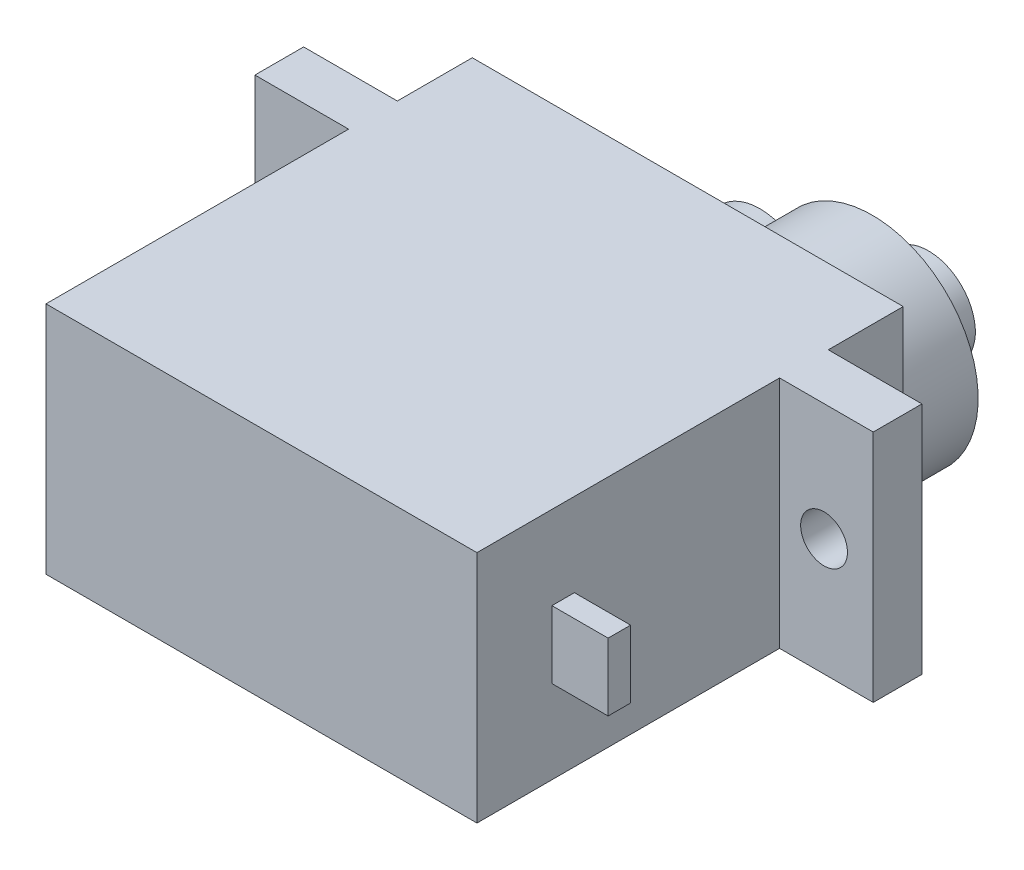
ISO-10303-21;
HEADER;
FILE_DESCRIPTION(('STEP AP214'),'2;1');
FILE_NAME('part.step','',(''),(''),'','','');
FILE_SCHEMA(('AUTOMOTIVE_DESIGN { 1 0 10303 214 1 1 1 1 }'));
ENDSEC;
DATA;
#1=APPLICATION_CONTEXT('core data for automotive mechanical design processes');
#2=APPLICATION_PROTOCOL_DEFINITION('international standard','automotive_design',2000,#1);
#3=PRODUCT_CONTEXT('',#1,'mechanical');
#4=PRODUCT('Part','Part','',(#3));
#5=PRODUCT_RELATED_PRODUCT_CATEGORY('part','',(#4));
#6=PRODUCT_DEFINITION_FORMATION('','',#4);
#7=PRODUCT_DEFINITION_CONTEXT('part definition',#1,'design');
#8=PRODUCT_DEFINITION('design','',#6,#7);
#9=PRODUCT_DEFINITION_SHAPE('','',#8);
#10=(LENGTH_UNIT() NAMED_UNIT(*) SI_UNIT(.MILLI.,.METRE.));
#11=(NAMED_UNIT(*) PLANE_ANGLE_UNIT() SI_UNIT($,.RADIAN.));
#12=(NAMED_UNIT(*) SI_UNIT($,.STERADIAN.) SOLID_ANGLE_UNIT());
#13=UNCERTAINTY_MEASURE_WITH_UNIT(LENGTH_MEASURE(1.E-05),#10,'distance_accuracy_value','');
#14=(GEOMETRIC_REPRESENTATION_CONTEXT(3) GLOBAL_UNCERTAINTY_ASSIGNED_CONTEXT((#13)) GLOBAL_UNIT_ASSIGNED_CONTEXT((#10,
#11,#12)) REPRESENTATION_CONTEXT('',''));
#15=CARTESIAN_POINT('',(0.,0.,0.));
#16=DIRECTION('',(0.,0.,1.));
#17=DIRECTION('',(1.,0.,0.));
#18=AXIS2_PLACEMENT_3D('',#15,#16,#17);
#19=CARTESIAN_POINT('',(23.,12.5,0.));
#20=DIRECTION('',(-1.,0.,0.));
#21=DIRECTION('',(0.,0.,1.));
#22=AXIS2_PLACEMENT_3D('',#19,#20,#21);
#23=PLANE('',#22);
#24=DIRECTION('',(0.,0.,-1.));
#25=VECTOR('',#24,1.);
#26=CARTESIAN_POINT('',(23.,0.,0.));
#27=LINE('',#26,#25);
#28=CARTESIAN_POINT('',(23.,0.,0.));
#29=VERTEX_POINT('',#28);
#30=CARTESIAN_POINT('',(23.,0.,-16.15));
#31=VERTEX_POINT('',#30);
#32=EDGE_CURVE('E273',#29,#31,#27,.T.);
#33=ORIENTED_EDGE('',*,*,#32,.T.);
#34=DIRECTION('',(0.,-1.,0.));
#35=VECTOR('',#34,1.);
#36=CARTESIAN_POINT('',(23.,12.5,-16.15));
#37=LINE('',#36,#35);
#38=CARTESIAN_POINT('',(23.,12.5,-16.15));
#39=VERTEX_POINT('',#38);
#40=EDGE_CURVE('E302',#39,#31,#37,.T.);
#41=ORIENTED_EDGE('',*,*,#40,.F.);
#42=DIRECTION('',(0.,0.,-1.));
#43=VECTOR('',#42,1.);
#44=CARTESIAN_POINT('',(23.,12.5,0.));
#45=LINE('',#44,#43);
#46=CARTESIAN_POINT('',(23.,12.5,0.));
#47=VERTEX_POINT('',#46);
#48=EDGE_CURVE('E248',#47,#39,#45,.T.);
#49=ORIENTED_EDGE('',*,*,#48,.F.);
#50=DIRECTION('',(0.,-1.,0.));
#51=VECTOR('',#50,1.);
#52=CARTESIAN_POINT('',(23.,12.5,0.));
#53=LINE('',#52,#51);
#54=EDGE_CURVE('E305',#47,#29,#53,.T.);
#55=ORIENTED_EDGE('',*,*,#54,.T.);
#56=EDGE_LOOP('',(#33,#41,#49,#55));
#57=FACE_BOUND('',#56,.T.);
#58=DIRECTION('',(0.,-1.,0.));
#59=VECTOR('',#58,1.);
#60=CARTESIAN_POINT('',(23.,8.05,-4.));
#61=LINE('',#60,#59);
#62=CARTESIAN_POINT('',(23.,8.05,-4.));
#63=VERTEX_POINT('',#62);
#64=CARTESIAN_POINT('',(23.,4.45,-4.));
#65=VERTEX_POINT('',#64);
#66=EDGE_CURVE('E185',#63,#65,#61,.T.);
#67=ORIENTED_EDGE('',*,*,#66,.F.);
#68=DIRECTION('',(0.,0.,1.));
#69=VECTOR('',#68,1.);
#70=CARTESIAN_POINT('',(23.,8.05,-4.));
#71=LINE('',#70,#69);
#72=CARTESIAN_POINT('',(23.,8.05,-5.2));
#73=VERTEX_POINT('',#72);
#74=EDGE_CURVE('E182',#73,#63,#71,.T.);
#75=ORIENTED_EDGE('',*,*,#74,.F.);
#76=DIRECTION('',(0.,1.,0.));
#77=VECTOR('',#76,1.);
#78=CARTESIAN_POINT('',(23.,8.05,-5.2));
#79=LINE('',#78,#77);
#80=CARTESIAN_POINT('',(23.,4.45,-5.2));
#81=VERTEX_POINT('',#80);
#82=EDGE_CURVE('E58',#81,#73,#79,.T.);
#83=ORIENTED_EDGE('',*,*,#82,.F.);
#84=DIRECTION('',(0.,0.,-1.));
#85=VECTOR('',#84,1.);
#86=CARTESIAN_POINT('',(23.,4.45,-4.));
#87=LINE('',#86,#85);
#88=EDGE_CURVE('E53',#65,#81,#87,.T.);
#89=ORIENTED_EDGE('',*,*,#88,.F.);
#90=EDGE_LOOP('',(#67,#75,#83,#89));
#91=FACE_BOUND('',#90,.T.);
#92=ADVANCED_FACE('F38',(#57,#91),#23,.F.);
#93=CARTESIAN_POINT('',(17.35,6.25,-26.75));
#94=DIRECTION('',(0.,0.,1.));
#95=DIRECTION('',(1.,0.,0.));
#96=AXIS2_PLACEMENT_3D('',#93,#94,#95);
#97=CYLINDRICAL_SURFACE('',#96,5.65);
#98=DIRECTION('',(0.,0.,1.));
#99=VECTOR('',#98,1.);
#100=CARTESIAN_POINT('',(12.415,3.49895020037805,-24.75));
#101=LINE('',#100,#99);
#102=CARTESIAN_POINT('',(12.415,3.49895020037805,-26.75));
#103=VERTEX_POINT('',#102);
#104=CARTESIAN_POINT('',(12.415,3.49895020037805,-22.75));
#105=VERTEX_POINT('',#104);
#106=EDGE_CURVE('E210',#103,#105,#101,.T.);
#107=ORIENTED_EDGE('',*,*,#106,.F.);
#108=CARTESIAN_POINT('',(17.35,6.25,-26.75));
#109=DIRECTION('',(0.,0.,-1.));
#110=DIRECTION('',(-1.,0.,0.));
#111=AXIS2_PLACEMENT_3D('',#108,#109,#110);
#112=CIRCLE('',#111,5.65);
#113=CARTESIAN_POINT('',(12.415,9.00104979962196,-26.75));
#114=VERTEX_POINT('',#113);
#115=EDGE_CURVE('E225',#114,#103,#112,.T.);
#116=ORIENTED_EDGE('',*,*,#115,.F.);
#117=DIRECTION('',(0.,0.,1.));
#118=VECTOR('',#117,1.);
#119=CARTESIAN_POINT('',(12.415,9.00104979962196,-24.75));
#120=LINE('',#119,#118);
#121=CARTESIAN_POINT('',(12.415,9.00104979962196,-22.75));
#122=VERTEX_POINT('',#121);
#123=EDGE_CURVE('E206',#122,#114,#120,.F.);
#124=ORIENTED_EDGE('',*,*,#123,.F.);
#125=CARTESIAN_POINT('',(17.35,6.25,-22.75));
#126=DIRECTION('',(0.,0.,-1.));
#127=DIRECTION('',(-1.,0.,0.));
#128=AXIS2_PLACEMENT_3D('',#125,#126,#127);
#129=CIRCLE('',#128,5.65);
#130=CARTESIAN_POINT('',(23.,6.25,-22.75));
#131=VERTEX_POINT('',#130);
#132=EDGE_CURVE('E222',#122,#131,#129,.T.);
#133=ORIENTED_EDGE('',*,*,#132,.T.);
#134=EDGE_CURVE('E229',#131,#105,#129,.T.);
#135=ORIENTED_EDGE('',*,*,#134,.T.);
#136=EDGE_LOOP('',(#107,#116,#124,#133,#135));
#137=FACE_BOUND('',#136,.T.);
#138=ADVANCED_FACE('F377',(#137),#97,.T.);
#139=CARTESIAN_POINT('',(0.,12.5,-18.75));
#140=DIRECTION('',(0.,0.,-1.));
#141=DIRECTION('',(-1.,0.,0.));
#142=AXIS2_PLACEMENT_3D('',#139,#140,#141);
#143=PLANE('',#142);
#144=CARTESIAN_POINT('',(-2.375,6.25,-18.75));
#145=DIRECTION('',(0.,0.,-1.));
#146=DIRECTION('',(-1.,0.,0.));
#147=AXIS2_PLACEMENT_3D('',#144,#145,#146);
#148=CIRCLE('',#147,1.25);
#149=CARTESIAN_POINT('',(-3.625,6.25,-18.75));
#150=VERTEX_POINT('',#149);
#151=EDGE_CURVE('E198',#150,#150,#148,.T.);
#152=ORIENTED_EDGE('',*,*,#151,.F.);
#153=EDGE_LOOP('',(#152));
#154=FACE_BOUND('',#153,.T.);
#155=DIRECTION('',(1.,0.,0.));
#156=VECTOR('',#155,1.);
#157=CARTESIAN_POINT('',(0.,0.,-18.75));
#158=LINE('',#157,#156);
#159=CARTESIAN_POINT('',(-5.,0.,-18.75));
#160=VERTEX_POINT('',#159);
#161=CARTESIAN_POINT('',(0.,0.,-18.75));
#162=VERTEX_POINT('',#161);
#163=EDGE_CURVE('E228',#160,#162,#158,.T.);
#164=ORIENTED_EDGE('',*,*,#163,.F.);
#165=DIRECTION('',(0.,-1.,0.));
#166=VECTOR('',#165,1.);
#167=CARTESIAN_POINT('',(-5.,12.5,-18.75));
#168=LINE('',#167,#166);
#169=CARTESIAN_POINT('',(-5.,12.5,-18.75));
#170=VERTEX_POINT('',#169);
#171=EDGE_CURVE('E11',#170,#160,#168,.T.);
#172=ORIENTED_EDGE('',*,*,#171,.F.);
#173=DIRECTION('',(1.,0.,0.));
#174=VECTOR('',#173,1.);
#175=CARTESIAN_POINT('',(0.,12.5,-18.75));
#176=LINE('',#175,#174);
#177=CARTESIAN_POINT('',(0.,12.5,-18.75));
#178=VERTEX_POINT('',#177);
#179=EDGE_CURVE('E232',#170,#178,#176,.T.);
#180=ORIENTED_EDGE('',*,*,#179,.T.);
#181=DIRECTION('',(0.,-1.,0.));
#182=VECTOR('',#181,1.);
#183=CARTESIAN_POINT('',(0.,12.5,-18.75));
#184=LINE('',#183,#182);
#185=EDGE_CURVE('E285',#178,#162,#184,.T.);
#186=ORIENTED_EDGE('',*,*,#185,.T.);
#187=EDGE_LOOP('',(#164,#172,#180,#186));
#188=FACE_BOUND('',#187,.T.);
#189=ADVANCED_FACE('F40',(#154,#188),#143,.T.);
#190=CARTESIAN_POINT('',(-5.,12.5,0.));
#191=DIRECTION('',(-1.,0.,0.));
#192=DIRECTION('',(0.,0.,1.));
#193=AXIS2_PLACEMENT_3D('',#190,#191,#192);
#194=PLANE('',#193);
#195=DIRECTION('',(0.,0.,-1.));
#196=VECTOR('',#195,1.);
#197=CARTESIAN_POINT('',(-5.,0.,0.));
#198=LINE('',#197,#196);
#199=CARTESIAN_POINT('',(-5.,0.,-16.15));
#200=VERTEX_POINT('',#199);
#201=EDGE_CURVE('E262',#200,#160,#198,.T.);
#202=ORIENTED_EDGE('',*,*,#201,.F.);
#203=DIRECTION('',(0.,-1.,0.));
#204=VECTOR('',#203,1.);
#205=CARTESIAN_POINT('',(-5.,12.5,-16.15));
#206=LINE('',#205,#204);
#207=CARTESIAN_POINT('',(-5.,12.5,-16.15));
#208=VERTEX_POINT('',#207);
#209=EDGE_CURVE('E46',#208,#200,#206,.T.);
#210=ORIENTED_EDGE('',*,*,#209,.F.);
#211=DIRECTION('',(0.,0.,-1.));
#212=VECTOR('',#211,1.);
#213=CARTESIAN_POINT('',(-5.,12.5,0.));
#214=LINE('',#213,#212);
#215=EDGE_CURVE('E235',#208,#170,#214,.T.);
#216=ORIENTED_EDGE('',*,*,#215,.T.);
#217=ORIENTED_EDGE('',*,*,#171,.T.);
#218=EDGE_LOOP('',(#202,#210,#216,#217));
#219=FACE_BOUND('',#218,.T.);
#220=ADVANCED_FACE('F318',(#219),#194,.T.);
#221=CARTESIAN_POINT('',(0.,12.5,-16.15));
#222=DIRECTION('',(0.,0.,1.));
#223=DIRECTION('',(1.,0.,0.));
#224=AXIS2_PLACEMENT_3D('',#221,#222,#223);
#225=PLANE('',#224);
#226=CARTESIAN_POINT('',(-2.375,6.25,-16.15));
#227=DIRECTION('',(0.,0.,1.));
#228=DIRECTION('',(1.,0.,0.));
#229=AXIS2_PLACEMENT_3D('',#226,#227,#228);
#230=CIRCLE('',#229,1.25);
#231=CARTESIAN_POINT('',(-1.125,6.25,-16.15));
#232=VERTEX_POINT('',#231);
#233=EDGE_CURVE('E197',#232,#232,#230,.F.);
#234=ORIENTED_EDGE('',*,*,#233,.T.);
#235=EDGE_LOOP('',(#234));
#236=FACE_BOUND('',#235,.T.);
#237=DIRECTION('',(-1.,0.,0.));
#238=VECTOR('',#237,1.);
#239=CARTESIAN_POINT('',(0.,0.,-16.15));
#240=LINE('',#239,#238);
#241=CARTESIAN_POINT('',(0.,0.,-16.15));
#242=VERTEX_POINT('',#241);
#243=EDGE_CURVE('E265',#242,#200,#240,.T.);
#244=ORIENTED_EDGE('',*,*,#243,.F.);
#245=DIRECTION('',(0.,-1.,0.));
#246=VECTOR('',#245,1.);
#247=CARTESIAN_POINT('',(0.,12.5,-16.15));
#248=LINE('',#247,#246);
#249=CARTESIAN_POINT('',(0.,12.5,-16.15));
#250=VERTEX_POINT('',#249);
#251=EDGE_CURVE('E310',#250,#242,#248,.T.);
#252=ORIENTED_EDGE('',*,*,#251,.F.);
#253=DIRECTION('',(-1.,0.,0.));
#254=VECTOR('',#253,1.);
#255=CARTESIAN_POINT('',(0.,12.5,-16.15));
#256=LINE('',#255,#254);
#257=EDGE_CURVE('E239',#250,#208,#256,.T.);
#258=ORIENTED_EDGE('',*,*,#257,.T.);
#259=ORIENTED_EDGE('',*,*,#209,.T.);
#260=EDGE_LOOP('',(#244,#252,#258,#259));
#261=FACE_BOUND('',#260,.T.);
#262=ADVANCED_FACE('F314',(#236,#261),#225,.T.);
#263=CARTESIAN_POINT('',(0.,12.5,0.));
#264=DIRECTION('',(-1.,0.,0.));
#265=DIRECTION('',(0.,0.,1.));
#266=AXIS2_PLACEMENT_3D('',#263,#264,#265);
#267=PLANE('',#266);
#268=DIRECTION('',(0.,0.,-1.));
#269=VECTOR('',#268,1.);
#270=CARTESIAN_POINT('',(0.,0.,0.));
#271=LINE('',#270,#269);
#272=CARTESIAN_POINT('',(0.,0.,0.));
#273=VERTEX_POINT('',#272);
#274=EDGE_CURVE('E268',#273,#242,#271,.T.);
#275=ORIENTED_EDGE('',*,*,#274,.F.);
#276=DIRECTION('',(0.,-1.,0.));
#277=VECTOR('',#276,1.);
#278=CARTESIAN_POINT('',(0.,12.5,0.));
#279=LINE('',#278,#277);
#280=CARTESIAN_POINT('',(0.,12.5,0.));
#281=VERTEX_POINT('',#280);
#282=EDGE_CURVE('E308',#281,#273,#279,.T.);
#283=ORIENTED_EDGE('',*,*,#282,.F.);
#284=DIRECTION('',(0.,0.,-1.));
#285=VECTOR('',#284,1.);
#286=CARTESIAN_POINT('',(0.,12.5,0.));
#287=LINE('',#286,#285);
#288=EDGE_CURVE('E242',#281,#250,#287,.T.);
#289=ORIENTED_EDGE('',*,*,#288,.T.);
#290=ORIENTED_EDGE('',*,*,#251,.T.);
#291=EDGE_LOOP('',(#275,#283,#289,#290));
#292=FACE_BOUND('',#291,.T.);
#293=ADVANCED_FACE('F326',(#292),#267,.T.);
#294=CARTESIAN_POINT('',(0.,12.5,0.));
#295=DIRECTION('',(0.,0.,-1.));
#296=DIRECTION('',(-1.,0.,0.));
#297=AXIS2_PLACEMENT_3D('',#294,#295,#296);
#298=PLANE('',#297);
#299=DIRECTION('',(1.,0.,0.));
#300=VECTOR('',#299,1.);
#301=CARTESIAN_POINT('',(0.,0.,0.));
#302=LINE('',#301,#300);
#303=EDGE_CURVE('E271',#273,#29,#302,.T.);
#304=ORIENTED_EDGE('',*,*,#303,.T.);
#305=ORIENTED_EDGE('',*,*,#54,.F.);
#306=DIRECTION('',(1.,0.,0.));
#307=VECTOR('',#306,1.);
#308=CARTESIAN_POINT('',(0.,12.5,0.));
#309=LINE('',#308,#307);
#310=EDGE_CURVE('E245',#281,#47,#309,.T.);
#311=ORIENTED_EDGE('',*,*,#310,.F.);
#312=ORIENTED_EDGE('',*,*,#282,.T.);
#313=EDGE_LOOP('',(#304,#305,#311,#312));
#314=FACE_BOUND('',#313,.T.);
#315=ADVANCED_FACE('F372',(#314),#298,.F.);
#316=CARTESIAN_POINT('',(0.,12.5,-16.15));
#317=DIRECTION('',(0.,0.,-1.));
#318=DIRECTION('',(-1.,0.,0.));
#319=AXIS2_PLACEMENT_3D('',#316,#317,#318);
#320=PLANE('',#319);
#321=CARTESIAN_POINT('',(25.375,6.25,-16.15));
#322=DIRECTION('',(0.,0.,-1.));
#323=DIRECTION('',(-1.,0.,0.));
#324=AXIS2_PLACEMENT_3D('',#321,#322,#323);
#325=CIRCLE('',#324,1.25);
#326=CARTESIAN_POINT('',(24.125,6.25,-16.15));
#327=VERTEX_POINT('',#326);
#328=EDGE_CURVE('E189',#327,#327,#325,.F.);
#329=ORIENTED_EDGE('',*,*,#328,.F.);
#330=EDGE_LOOP('',(#329));
#331=FACE_BOUND('',#330,.T.);
#332=DIRECTION('',(1.,0.,0.));
#333=VECTOR('',#332,1.);
#334=CARTESIAN_POINT('',(0.,0.,-16.15));
#335=LINE('',#334,#333);
#336=CARTESIAN_POINT('',(28.,0.,-16.15));
#337=VERTEX_POINT('',#336);
#338=EDGE_CURVE('E275',#31,#337,#335,.T.);
#339=ORIENTED_EDGE('',*,*,#338,.T.);
#340=DIRECTION('',(0.,-1.,0.));
#341=VECTOR('',#340,1.);
#342=CARTESIAN_POINT('',(28.,12.5,-16.15));
#343=LINE('',#342,#341);
#344=CARTESIAN_POINT('',(28.,12.5,-16.15));
#345=VERTEX_POINT('',#344);
#346=EDGE_CURVE('E299',#345,#337,#343,.T.);
#347=ORIENTED_EDGE('',*,*,#346,.F.);
#348=DIRECTION('',(1.,0.,0.));
#349=VECTOR('',#348,1.);
#350=CARTESIAN_POINT('',(0.,12.5,-16.15));
#351=LINE('',#350,#349);
#352=EDGE_CURVE('E250',#39,#345,#351,.T.);
#353=ORIENTED_EDGE('',*,*,#352,.F.);
#354=ORIENTED_EDGE('',*,*,#40,.T.);
#355=EDGE_LOOP('',(#339,#347,#353,#354));
#356=FACE_BOUND('',#355,.T.);
#357=ADVANCED_FACE('F365',(#331,#356),#320,.F.);
#358=CARTESIAN_POINT('',(28.,12.5,0.));
#359=DIRECTION('',(-1.,0.,0.));
#360=DIRECTION('',(0.,0.,1.));
#361=AXIS2_PLACEMENT_3D('',#358,#359,#360);
#362=PLANE('',#361);
#363=DIRECTION('',(0.,0.,-1.));
#364=VECTOR('',#363,1.);
#365=CARTESIAN_POINT('',(28.,0.,0.));
#366=LINE('',#365,#364);
#367=CARTESIAN_POINT('',(28.,0.,-18.75));
#368=VERTEX_POINT('',#367);
#369=EDGE_CURVE('E278',#337,#368,#366,.T.);
#370=ORIENTED_EDGE('',*,*,#369,.T.);
#371=DIRECTION('',(0.,-1.,0.));
#372=VECTOR('',#371,1.);
#373=CARTESIAN_POINT('',(28.,12.5,-18.75));
#374=LINE('',#373,#372);
#375=CARTESIAN_POINT('',(28.,12.5,-18.75));
#376=VERTEX_POINT('',#375);
#377=EDGE_CURVE('E296',#376,#368,#374,.T.);
#378=ORIENTED_EDGE('',*,*,#377,.F.);
#379=DIRECTION('',(0.,0.,-1.));
#380=VECTOR('',#379,1.);
#381=CARTESIAN_POINT('',(28.,12.5,0.));
#382=LINE('',#381,#380);
#383=EDGE_CURVE('E253',#345,#376,#382,.T.);
#384=ORIENTED_EDGE('',*,*,#383,.F.);
#385=ORIENTED_EDGE('',*,*,#346,.T.);
#386=EDGE_LOOP('',(#370,#378,#384,#385));
#387=FACE_BOUND('',#386,.T.);
#388=ADVANCED_FACE('F361',(#387),#362,.F.);
#389=CARTESIAN_POINT('',(0.,12.5,-18.75));
#390=DIRECTION('',(0.,0.,1.));
#391=DIRECTION('',(1.,0.,0.));
#392=AXIS2_PLACEMENT_3D('',#389,#390,#391);
#393=PLANE('',#392);
#394=CARTESIAN_POINT('',(25.375,6.25,-18.75));
#395=DIRECTION('',(0.,0.,-1.));
#396=DIRECTION('',(-1.,0.,0.));
#397=AXIS2_PLACEMENT_3D('',#394,#395,#396);
#398=CIRCLE('',#397,1.25);
#399=CARTESIAN_POINT('',(24.125,6.25,-18.75));
#400=VERTEX_POINT('',#399);
#401=EDGE_CURVE('E186',#400,#400,#398,.T.);
#402=ORIENTED_EDGE('',*,*,#401,.F.);
#403=EDGE_LOOP('',(#402));
#404=FACE_BOUND('',#403,.T.);
#405=DIRECTION('',(-1.,0.,0.));
#406=VECTOR('',#405,1.);
#407=CARTESIAN_POINT('',(0.,0.,-18.75));
#408=LINE('',#407,#406);
#409=CARTESIAN_POINT('',(23.,0.,-18.75));
#410=VERTEX_POINT('',#409);
#411=EDGE_CURVE('E280',#368,#410,#408,.T.);
#412=ORIENTED_EDGE('',*,*,#411,.T.);
#413=DIRECTION('',(0.,-1.,0.));
#414=VECTOR('',#413,1.);
#415=CARTESIAN_POINT('',(23.,12.5,-18.75));
#416=LINE('',#415,#414);
#417=CARTESIAN_POINT('',(23.,12.5,-18.75));
#418=VERTEX_POINT('',#417);
#419=EDGE_CURVE('E293',#418,#410,#416,.T.);
#420=ORIENTED_EDGE('',*,*,#419,.F.);
#421=DIRECTION('',(-1.,0.,0.));
#422=VECTOR('',#421,1.);
#423=CARTESIAN_POINT('',(0.,12.5,-18.75));
#424=LINE('',#423,#422);
#425=EDGE_CURVE('E255',#376,#418,#424,.T.);
#426=ORIENTED_EDGE('',*,*,#425,.F.);
#427=ORIENTED_EDGE('',*,*,#377,.T.);
#428=EDGE_LOOP('',(#412,#420,#426,#427));
#429=FACE_BOUND('',#428,.T.);
#430=ADVANCED_FACE('F357',(#404,#429),#393,.F.);
#431=CARTESIAN_POINT('',(23.,0.,-22.75));
#432=VERTEX_POINT('',#431);
#433=EDGE_CURVE('E276',#410,#432,#27,.T.);
#434=ORIENTED_EDGE('',*,*,#433,.T.);
#435=DIRECTION('',(0.,-1.,0.));
#436=VECTOR('',#435,1.);
#437=CARTESIAN_POINT('',(23.,12.5,-22.75));
#438=LINE('',#437,#436);
#439=EDGE_CURVE('E289',#131,#432,#438,.T.);
#440=ORIENTED_EDGE('',*,*,#439,.F.);
#441=CARTESIAN_POINT('',(23.,12.5,-22.75));
#442=VERTEX_POINT('',#441);
#443=EDGE_CURVE('E290',#442,#131,#438,.T.);
#444=ORIENTED_EDGE('',*,*,#443,.F.);
#445=EDGE_CURVE('E251',#418,#442,#45,.T.);
#446=ORIENTED_EDGE('',*,*,#445,.F.);
#447=ORIENTED_EDGE('',*,*,#419,.T.);
#448=EDGE_LOOP('',(#434,#440,#444,#446,#447));
#449=FACE_BOUND('',#448,.T.);
#450=ADVANCED_FACE('F351',(#449),#23,.F.);
#451=CARTESIAN_POINT('',(0.,12.5,-22.75));
#452=DIRECTION('',(0.,0.,-1.));
#453=DIRECTION('',(-1.,0.,0.));
#454=AXIS2_PLACEMENT_3D('',#451,#452,#453);
#455=PLANE('',#454);
#456=ORIENTED_EDGE('',*,*,#132,.F.);
#457=CARTESIAN_POINT('',(11.35,6.25,-22.75));
#458=DIRECTION('',(0.,0.,-1.));
#459=DIRECTION('',(-1.,0.,0.));
#460=AXIS2_PLACEMENT_3D('',#457,#458,#459);
#461=CIRCLE('',#460,2.95);
#462=EDGE_CURVE('E201',#105,#122,#461,.T.);
#463=ORIENTED_EDGE('',*,*,#462,.F.);
#464=ORIENTED_EDGE('',*,*,#134,.F.);
#465=ORIENTED_EDGE('',*,*,#439,.T.);
#466=DIRECTION('',(1.,0.,0.));
#467=VECTOR('',#466,1.);
#468=CARTESIAN_POINT('',(0.,0.,-22.75));
#469=LINE('',#468,#467);
#470=CARTESIAN_POINT('',(0.,0.,-22.75));
#471=VERTEX_POINT('',#470);
#472=EDGE_CURVE('E282',#471,#432,#469,.T.);
#473=ORIENTED_EDGE('',*,*,#472,.F.);
#474=DIRECTION('',(0.,-1.,0.));
#475=VECTOR('',#474,1.);
#476=CARTESIAN_POINT('',(0.,12.5,-22.75));
#477=LINE('',#476,#475);
#478=CARTESIAN_POINT('',(0.,12.5,-22.75));
#479=VERTEX_POINT('',#478);
#480=EDGE_CURVE('E287',#479,#471,#477,.T.);
#481=ORIENTED_EDGE('',*,*,#480,.F.);
#482=DIRECTION('',(1.,0.,0.));
#483=VECTOR('',#482,1.);
#484=CARTESIAN_POINT('',(0.,12.5,-22.75));
#485=LINE('',#484,#483);
#486=EDGE_CURVE('E257',#479,#442,#485,.T.);
#487=ORIENTED_EDGE('',*,*,#486,.T.);
#488=ORIENTED_EDGE('',*,*,#443,.T.);
#489=EDGE_LOOP('',(#456,#463,#464,#465,#473,#481,#487,#488));
#490=FACE_BOUND('',#489,.T.);
#491=ADVANCED_FACE('F343',(#490),#455,.T.);
#492=EDGE_CURVE('E236',#162,#471,#271,.T.);
#493=ORIENTED_EDGE('',*,*,#492,.F.);
#494=ORIENTED_EDGE('',*,*,#185,.F.);
#495=EDGE_CURVE('E246',#178,#479,#287,.T.);
#496=ORIENTED_EDGE('',*,*,#495,.T.);
#497=ORIENTED_EDGE('',*,*,#480,.T.);
#498=EDGE_LOOP('',(#493,#494,#496,#497));
#499=FACE_BOUND('',#498,.T.);
#500=ADVANCED_FACE('F339',(#499),#267,.T.);
#501=CARTESIAN_POINT('',(0.,12.5,0.));
#502=DIRECTION('',(0.,1.,0.));
#503=DIRECTION('',(0.,0.,1.));
#504=AXIS2_PLACEMENT_3D('',#501,#502,#503);
#505=PLANE('',#504);
#506=ORIENTED_EDGE('',*,*,#179,.F.);
#507=ORIENTED_EDGE('',*,*,#215,.F.);
#508=ORIENTED_EDGE('',*,*,#257,.F.);
#509=ORIENTED_EDGE('',*,*,#288,.F.);
#510=ORIENTED_EDGE('',*,*,#310,.T.);
#511=ORIENTED_EDGE('',*,*,#48,.T.);
#512=ORIENTED_EDGE('',*,*,#352,.T.);
#513=ORIENTED_EDGE('',*,*,#383,.T.);
#514=ORIENTED_EDGE('',*,*,#425,.T.);
#515=ORIENTED_EDGE('',*,*,#445,.T.);
#516=ORIENTED_EDGE('',*,*,#486,.F.);
#517=ORIENTED_EDGE('',*,*,#495,.F.);
#518=EDGE_LOOP('',(#506,#507,#508,#509,#510,#511,#512,#513,#514,#515,#516,#517));
#519=FACE_BOUND('',#518,.T.);
#520=ADVANCED_FACE('F331',(#519),#505,.T.);
#521=CARTESIAN_POINT('',(0.,0.,0.));
#522=DIRECTION('',(0.,1.,0.));
#523=DIRECTION('',(0.,0.,1.));
#524=AXIS2_PLACEMENT_3D('',#521,#522,#523);
#525=PLANE('',#524);
#526=ORIENTED_EDGE('',*,*,#163,.T.);
#527=ORIENTED_EDGE('',*,*,#492,.T.);
#528=ORIENTED_EDGE('',*,*,#472,.T.);
#529=ORIENTED_EDGE('',*,*,#433,.F.);
#530=ORIENTED_EDGE('',*,*,#411,.F.);
#531=ORIENTED_EDGE('',*,*,#369,.F.);
#532=ORIENTED_EDGE('',*,*,#338,.F.);
#533=ORIENTED_EDGE('',*,*,#32,.F.);
#534=ORIENTED_EDGE('',*,*,#303,.F.);
#535=ORIENTED_EDGE('',*,*,#274,.T.);
#536=ORIENTED_EDGE('',*,*,#243,.T.);
#537=ORIENTED_EDGE('',*,*,#201,.T.);
#538=EDGE_LOOP('',(#526,#527,#528,#529,#530,#531,#532,#533,#534,#535,#536,#537));
#539=FACE_BOUND('',#538,.T.);
#540=ADVANCED_FACE('F321',(#539),#525,.F.);
#541=CARTESIAN_POINT('',(17.35,6.25,-26.75));
#542=DIRECTION('',(0.,0.,-1.));
#543=DIRECTION('',(-1.,0.,0.));
#544=AXIS2_PLACEMENT_3D('',#541,#542,#543);
#545=PLANE('',#544);
#546=CARTESIAN_POINT('',(17.35,6.25,-26.75));
#547=DIRECTION('',(0.,0.,-1.));
#548=DIRECTION('',(-1.,0.,0.));
#549=AXIS2_PLACEMENT_3D('',#546,#547,#548);
#550=CIRCLE('',#549,2.5);
#551=CARTESIAN_POINT('',(14.85,6.25,-26.75));
#552=VERTEX_POINT('',#551);
#553=EDGE_CURVE('E216',#552,#552,#550,.T.);
#554=ORIENTED_EDGE('',*,*,#553,.F.);
#555=EDGE_LOOP('',(#554));
#556=FACE_BOUND('',#555,.T.);
#557=ORIENTED_EDGE('',*,*,#115,.T.);
#558=CARTESIAN_POINT('',(11.35,6.25,-26.75));
#559=DIRECTION('',(0.,0.,-1.));
#560=DIRECTION('',(-1.,0.,0.));
#561=AXIS2_PLACEMENT_3D('',#558,#559,#560);
#562=CIRCLE('',#561,2.95);
#563=EDGE_CURVE('E204',#103,#114,#562,.T.);
#564=ORIENTED_EDGE('',*,*,#563,.T.);
#565=EDGE_LOOP('',(#557,#564));
#566=FACE_BOUND('',#565,.T.);
#567=ADVANCED_FACE('F382',(#556,#566),#545,.T.);
#568=CARTESIAN_POINT('',(17.35,6.25,-29.75));
#569=DIRECTION('',(0.,0.,1.));
#570=DIRECTION('',(1.,0.,0.));
#571=AXIS2_PLACEMENT_3D('',#568,#569,#570);
#572=CYLINDRICAL_SURFACE('',#571,2.5);
#573=CARTESIAN_POINT('',(17.35,6.25,-29.75));
#574=DIRECTION('',(0.,0.,-1.));
#575=DIRECTION('',(-1.,0.,0.));
#576=AXIS2_PLACEMENT_3D('',#573,#574,#575);
#577=CIRCLE('',#576,2.5);
#578=CARTESIAN_POINT('',(14.85,6.25,-29.75));
#579=VERTEX_POINT('',#578);
#580=EDGE_CURVE('E219',#579,#579,#577,.T.);
#581=ORIENTED_EDGE('',*,*,#580,.F.);
#582=EDGE_LOOP('',(#581));
#583=FACE_BOUND('',#582,.T.);
#584=ORIENTED_EDGE('',*,*,#553,.T.);
#585=EDGE_LOOP('',(#584));
#586=FACE_BOUND('',#585,.T.);
#587=ADVANCED_FACE('F384',(#583,#586),#572,.T.);
#588=CARTESIAN_POINT('',(17.35,6.25,-29.75));
#589=DIRECTION('',(0.,0.,-1.));
#590=DIRECTION('',(-1.,0.,0.));
#591=AXIS2_PLACEMENT_3D('',#588,#589,#590);
#592=PLANE('',#591);
#593=CARTESIAN_POINT('',(17.35,6.25,-29.75));
#594=DIRECTION('',(0.,0.,-1.));
#595=DIRECTION('',(-1.,0.,0.));
#596=AXIS2_PLACEMENT_3D('',#593,#594,#595);
#597=CIRCLE('',#596,0.9);
#598=CARTESIAN_POINT('',(16.45,6.25,-29.75));
#599=VERTEX_POINT('',#598);
#600=EDGE_CURVE('E212',#599,#599,#597,.T.);
#601=ORIENTED_EDGE('',*,*,#600,.F.);
#602=EDGE_LOOP('',(#601));
#603=FACE_BOUND('',#602,.T.);
#604=ORIENTED_EDGE('',*,*,#580,.T.);
#605=EDGE_LOOP('',(#604));
#606=FACE_BOUND('',#605,.T.);
#607=ADVANCED_FACE('F391',(#603,#606),#592,.T.);
#608=CARTESIAN_POINT('',(17.35,6.25,-23.25));
#609=DIRECTION('',(0.,0.,-1.));
#610=DIRECTION('',(-1.,0.,0.));
#611=AXIS2_PLACEMENT_3D('',#608,#609,#610);
#612=CYLINDRICAL_SURFACE('',#611,0.9);
#613=CARTESIAN_POINT('',(17.35,6.25,-23.25));
#614=DIRECTION('',(0.,0.,-1.));
#615=DIRECTION('',(-1.,0.,0.));
#616=AXIS2_PLACEMENT_3D('',#613,#614,#615);
#617=CIRCLE('',#616,0.9);
#618=CARTESIAN_POINT('',(16.45,6.25,-23.25));
#619=VERTEX_POINT('',#618);
#620=EDGE_CURVE('E213',#619,#619,#617,.T.);
#621=ORIENTED_EDGE('',*,*,#620,.F.);
#622=EDGE_LOOP('',(#621));
#623=FACE_BOUND('',#622,.T.);
#624=ORIENTED_EDGE('',*,*,#600,.T.);
#625=EDGE_LOOP('',(#624));
#626=FACE_BOUND('',#625,.T.);
#627=ADVANCED_FACE('F450',(#623,#626),#612,.F.);
#628=CARTESIAN_POINT('',(17.35,6.25,-23.25));
#629=DIRECTION('',(0.,0.,-1.));
#630=DIRECTION('',(-1.,0.,0.));
#631=AXIS2_PLACEMENT_3D('',#628,#629,#630);
#632=PLANE('',#631);
#633=ORIENTED_EDGE('',*,*,#620,.T.);
#634=EDGE_LOOP('',(#633));
#635=FACE_BOUND('',#634,.T.);
#636=ADVANCED_FACE('F443',(#635),#632,.T.);
#637=CARTESIAN_POINT('',(11.35,6.25,-26.75));
#638=DIRECTION('',(0.,0.,1.));
#639=DIRECTION('',(1.,0.,0.));
#640=AXIS2_PLACEMENT_3D('',#637,#638,#639);
#641=CYLINDRICAL_SURFACE('',#640,2.95);
#642=ORIENTED_EDGE('',*,*,#563,.F.);
#643=ORIENTED_EDGE('',*,*,#106,.T.);
#644=ORIENTED_EDGE('',*,*,#462,.T.);
#645=ORIENTED_EDGE('',*,*,#123,.T.);
#646=EDGE_LOOP('',(#642,#643,#644,#645));
#647=FACE_BOUND('',#646,.T.);
#648=ADVANCED_FACE('F380',(#647),#641,.T.);
#649=CARTESIAN_POINT('',(-2.375,6.25,0.001000000000001));
#650=DIRECTION('',(0.,0.,-1.));
#651=DIRECTION('',(-1.,0.,0.));
#652=AXIS2_PLACEMENT_3D('',#649,#650,#651);
#653=CYLINDRICAL_SURFACE('',#652,1.25);
#654=ORIENTED_EDGE('',*,*,#233,.F.);
#655=EDGE_LOOP('',(#654));
#656=FACE_BOUND('',#655,.T.);
#657=ORIENTED_EDGE('',*,*,#151,.T.);
#658=EDGE_LOOP('',(#657));
#659=FACE_BOUND('',#658,.T.);
#660=ADVANCED_FACE('F432',(#656,#659),#653,.F.);
#661=CARTESIAN_POINT('',(25.375,6.25,0.001000000000001));
#662=DIRECTION('',(0.,0.,-1.));
#663=DIRECTION('',(-1.,0.,0.));
#664=AXIS2_PLACEMENT_3D('',#661,#662,#663);
#665=CYLINDRICAL_SURFACE('',#664,1.25);
#666=ORIENTED_EDGE('',*,*,#401,.T.);
#667=EDGE_LOOP('',(#666));
#668=FACE_BOUND('',#667,.T.);
#669=ORIENTED_EDGE('',*,*,#328,.T.);
#670=EDGE_LOOP('',(#669));
#671=FACE_BOUND('',#670,.T.);
#672=ADVANCED_FACE('F434',(#668,#671),#665,.F.);
#673=CARTESIAN_POINT('',(26.,8.05,-4.));
#674=DIRECTION('',(0.,0.,-1.));
#675=DIRECTION('',(-1.,0.,0.));
#676=AXIS2_PLACEMENT_3D('',#673,#674,#675);
#677=PLANE('',#676);
#678=ORIENTED_EDGE('',*,*,#66,.T.);
#679=DIRECTION('',(-1.,0.,0.));
#680=VECTOR('',#679,1.);
#681=CARTESIAN_POINT('',(26.,4.45,-4.));
#682=LINE('',#681,#680);
#683=CARTESIAN_POINT('',(26.,4.45,-4.));
#684=VERTEX_POINT('',#683);
#685=EDGE_CURVE('E166',#684,#65,#682,.T.);
#686=ORIENTED_EDGE('',*,*,#685,.F.);
#687=DIRECTION('',(0.,-1.,0.));
#688=VECTOR('',#687,1.);
#689=CARTESIAN_POINT('',(26.,8.05,-4.));
#690=LINE('',#689,#688);
#691=CARTESIAN_POINT('',(26.,8.05,-4.));
#692=VERTEX_POINT('',#691);
#693=EDGE_CURVE('E173',#692,#684,#690,.T.);
#694=ORIENTED_EDGE('',*,*,#693,.F.);
#695=DIRECTION('',(-1.,0.,0.));
#696=VECTOR('',#695,1.);
#697=CARTESIAN_POINT('',(26.,8.05,-4.));
#698=LINE('',#697,#696);
#699=EDGE_CURVE('E571',#692,#63,#698,.T.);
#700=ORIENTED_EDGE('',*,*,#699,.T.);
#701=EDGE_LOOP('',(#678,#686,#694,#700));
#702=FACE_BOUND('',#701,.T.);
#703=ADVANCED_FACE('F184',(#702),#677,.F.);
#704=CARTESIAN_POINT('',(26.,4.45,-4.));
#705=DIRECTION('',(0.,1.,0.));
#706=DIRECTION('',(0.,0.,1.));
#707=AXIS2_PLACEMENT_3D('',#704,#705,#706);
#708=PLANE('',#707);
#709=ORIENTED_EDGE('',*,*,#88,.T.);
#710=DIRECTION('',(-1.,0.,0.));
#711=VECTOR('',#710,1.);
#712=CARTESIAN_POINT('',(26.,4.45,-5.2));
#713=LINE('',#712,#711);
#714=CARTESIAN_POINT('',(26.,4.45,-5.2));
#715=VERTEX_POINT('',#714);
#716=EDGE_CURVE('E169',#715,#81,#713,.T.);
#717=ORIENTED_EDGE('',*,*,#716,.F.);
#718=DIRECTION('',(0.,0.,-1.));
#719=VECTOR('',#718,1.);
#720=CARTESIAN_POINT('',(26.,4.45,-4.));
#721=LINE('',#720,#719);
#722=EDGE_CURVE('E162',#684,#715,#721,.T.);
#723=ORIENTED_EDGE('',*,*,#722,.F.);
#724=ORIENTED_EDGE('',*,*,#685,.T.);
#725=EDGE_LOOP('',(#709,#717,#723,#724));
#726=FACE_BOUND('',#725,.T.);
#727=ADVANCED_FACE('F164',(#726),#708,.F.);
#728=CARTESIAN_POINT('',(26.,8.05,-5.2));
#729=DIRECTION('',(0.,0.,1.));
#730=DIRECTION('',(1.,0.,0.));
#731=AXIS2_PLACEMENT_3D('',#728,#729,#730);
#732=PLANE('',#731);
#733=ORIENTED_EDGE('',*,*,#82,.T.);
#734=DIRECTION('',(-1.,0.,0.));
#735=VECTOR('',#734,1.);
#736=CARTESIAN_POINT('',(26.,8.05,-5.2));
#737=LINE('',#736,#735);
#738=CARTESIAN_POINT('',(26.,8.05,-5.2));
#739=VERTEX_POINT('',#738);
#740=EDGE_CURVE('E191',#739,#73,#737,.T.);
#741=ORIENTED_EDGE('',*,*,#740,.F.);
#742=DIRECTION('',(0.,1.,0.));
#743=VECTOR('',#742,1.);
#744=CARTESIAN_POINT('',(26.,8.05,-5.2));
#745=LINE('',#744,#743);
#746=EDGE_CURVE('E172',#715,#739,#745,.T.);
#747=ORIENTED_EDGE('',*,*,#746,.F.);
#748=ORIENTED_EDGE('',*,*,#716,.T.);
#749=EDGE_LOOP('',(#733,#741,#747,#748));
#750=FACE_BOUND('',#749,.T.);
#751=ADVANCED_FACE('F538',(#750),#732,.F.);
#752=CARTESIAN_POINT('',(26.,8.05,-4.));
#753=DIRECTION('',(0.,-1.,0.));
#754=DIRECTION('',(0.,0.,-1.));
#755=AXIS2_PLACEMENT_3D('',#752,#753,#754);
#756=PLANE('',#755);
#757=ORIENTED_EDGE('',*,*,#74,.T.);
#758=ORIENTED_EDGE('',*,*,#699,.F.);
#759=DIRECTION('',(0.,0.,1.));
#760=VECTOR('',#759,1.);
#761=CARTESIAN_POINT('',(26.,8.05,-4.));
#762=LINE('',#761,#760);
#763=EDGE_CURVE('E178',#739,#692,#762,.T.);
#764=ORIENTED_EDGE('',*,*,#763,.F.);
#765=ORIENTED_EDGE('',*,*,#740,.T.);
#766=EDGE_LOOP('',(#757,#758,#764,#765));
#767=FACE_BOUND('',#766,.T.);
#768=ADVANCED_FACE('F547',(#767),#756,.F.);
#769=CARTESIAN_POINT('',(26.,0.,0.));
#770=DIRECTION('',(1.,0.,0.));
#771=DIRECTION('',(0.,0.,-1.));
#772=AXIS2_PLACEMENT_3D('',#769,#770,#771);
#773=PLANE('',#772);
#774=ORIENTED_EDGE('',*,*,#693,.T.);
#775=ORIENTED_EDGE('',*,*,#722,.T.);
#776=ORIENTED_EDGE('',*,*,#746,.T.);
#777=ORIENTED_EDGE('',*,*,#763,.T.);
#778=EDGE_LOOP('',(#774,#775,#776,#777));
#779=FACE_BOUND('',#778,.T.);
#780=ADVANCED_FACE('F176',(#779),#773,.T.);
#781=CLOSED_SHELL('',(#92,#138,#189,#220,#262,#293,#315,#357,#388,#430,#450,#491,#500,#520,#540,
#567,#587,#607,#627,#636,#648,#660,#672,#703,#727,#751,#768,#780));
#782=MANIFOLD_SOLID_BREP('B2',#781);
#783=ADVANCED_BREP_SHAPE_REPRESENTATION('',(#18,#782),#14);
#784=SHAPE_DEFINITION_REPRESENTATION(#9,#783);
ENDSEC;
END-ISO-10303-21;
